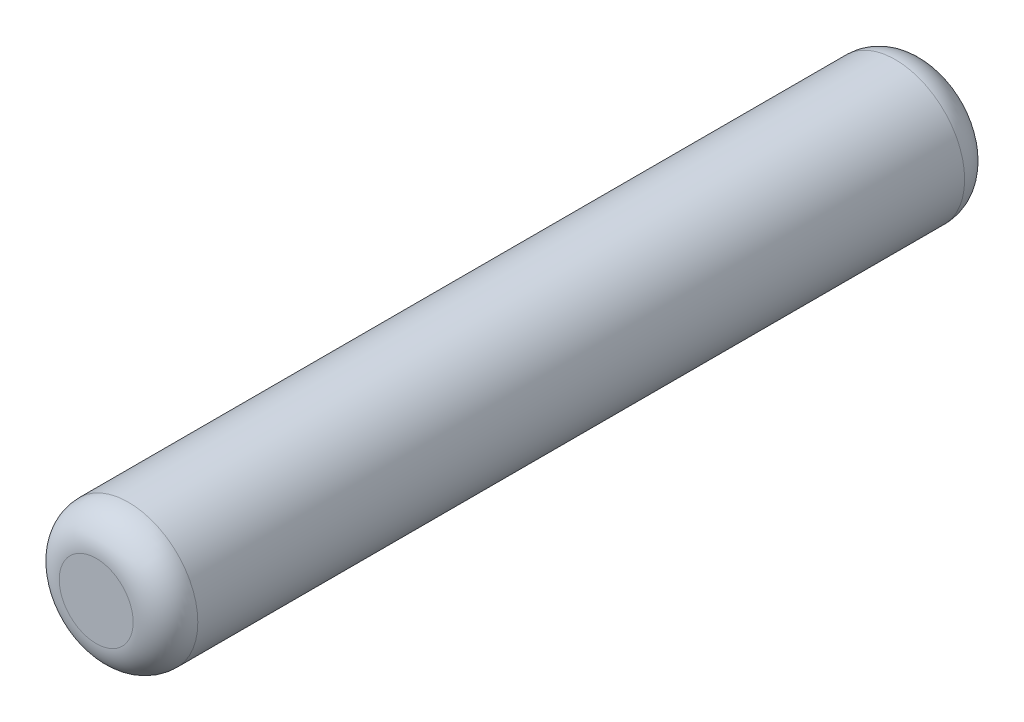
ISO-10303-21;
HEADER;
FILE_DESCRIPTION(('STEP AP214'),'2;1');
FILE_NAME('part.step','',(''),(''),'','','');
FILE_SCHEMA(('AUTOMOTIVE_DESIGN { 1 0 10303 214 1 1 1 1 }'));
ENDSEC;
DATA;
#1=APPLICATION_CONTEXT('core data for automotive mechanical design processes');
#2=APPLICATION_PROTOCOL_DEFINITION('international standard','automotive_design',2000,#1);
#3=PRODUCT_CONTEXT('',#1,'mechanical');
#4=PRODUCT('Part','Part','',(#3));
#5=PRODUCT_RELATED_PRODUCT_CATEGORY('part','',(#4));
#6=PRODUCT_DEFINITION_FORMATION('','',#4);
#7=PRODUCT_DEFINITION_CONTEXT('part definition',#1,'design');
#8=PRODUCT_DEFINITION('design','',#6,#7);
#9=PRODUCT_DEFINITION_SHAPE('','',#8);
#10=(LENGTH_UNIT() NAMED_UNIT(*) SI_UNIT(.MILLI.,.METRE.));
#11=(NAMED_UNIT(*) PLANE_ANGLE_UNIT() SI_UNIT($,.RADIAN.));
#12=(NAMED_UNIT(*) SI_UNIT($,.STERADIAN.) SOLID_ANGLE_UNIT());
#13=UNCERTAINTY_MEASURE_WITH_UNIT(LENGTH_MEASURE(1.E-05),#10,'distance_accuracy_value','');
#14=(GEOMETRIC_REPRESENTATION_CONTEXT(3) GLOBAL_UNCERTAINTY_ASSIGNED_CONTEXT((#13)) GLOBAL_UNIT_ASSIGNED_CONTEXT((#10,
#11,#12)) REPRESENTATION_CONTEXT('',''));
#15=CARTESIAN_POINT('',(0.,0.,0.));
#16=DIRECTION('',(0.,0.,1.));
#17=DIRECTION('',(1.,0.,0.));
#18=AXIS2_PLACEMENT_3D('',#15,#16,#17);
#19=CARTESIAN_POINT('',(0.,0.,4.5));
#20=DIRECTION('',(0.,0.,-1.));
#21=DIRECTION('',(-1.,0.,0.));
#22=AXIS2_PLACEMENT_3D('',#19,#20,#21);
#23=CYLINDRICAL_SURFACE('',#22,0.75);
#24=CARTESIAN_POINT('',(0.,0.,-4.15));
#25=DIRECTION('',(0.,0.,1.));
#26=DIRECTION('',(1.,0.,0.));
#27=AXIS2_PLACEMENT_3D('',#24,#25,#26);
#28=CIRCLE('',#27,0.75);
#29=CARTESIAN_POINT('',(0.75,0.,-4.15));
#30=VERTEX_POINT('',#29);
#31=EDGE_CURVE('E42',#30,#30,#28,.T.);
#32=ORIENTED_EDGE('',*,*,#31,.T.);
#33=EDGE_LOOP('',(#32));
#34=FACE_BOUND('',#33,.T.);
#35=CARTESIAN_POINT('',(0.,0.,4.15));
#36=DIRECTION('',(0.,0.,1.));
#37=DIRECTION('',(1.,0.,0.));
#38=AXIS2_PLACEMENT_3D('',#35,#36,#37);
#39=CIRCLE('',#38,0.75);
#40=CARTESIAN_POINT('',(0.75,0.,4.15));
#41=VERTEX_POINT('',#40);
#42=EDGE_CURVE('E46',#41,#41,#39,.F.);
#43=ORIENTED_EDGE('',*,*,#42,.T.);
#44=EDGE_LOOP('',(#43));
#45=FACE_BOUND('',#44,.T.);
#46=ADVANCED_FACE('F31',(#34,#45),#23,.T.);
#47=CARTESIAN_POINT('',(0.,0.,4.5));
#48=DIRECTION('',(0.,0.,1.));
#49=DIRECTION('',(1.,0.,0.));
#50=AXIS2_PLACEMENT_3D('',#47,#48,#49);
#51=PLANE('',#50);
#52=CARTESIAN_POINT('',(0.,0.,4.5));
#53=DIRECTION('',(0.,0.,1.));
#54=DIRECTION('',(1.,0.,0.));
#55=AXIS2_PLACEMENT_3D('',#52,#53,#54);
#56=CIRCLE('',#55,0.4);
#57=CARTESIAN_POINT('',(0.4,0.,4.5));
#58=VERTEX_POINT('',#57);
#59=EDGE_CURVE('E10',#58,#58,#56,.T.);
#60=ORIENTED_EDGE('',*,*,#59,.T.);
#61=EDGE_LOOP('',(#60));
#62=FACE_BOUND('',#61,.T.);
#63=ADVANCED_FACE('F62',(#62),#51,.T.);
#64=CARTESIAN_POINT('',(0.,0.,-4.5));
#65=DIRECTION('',(0.,0.,1.));
#66=DIRECTION('',(1.,0.,0.));
#67=AXIS2_PLACEMENT_3D('',#64,#65,#66);
#68=PLANE('',#67);
#69=CARTESIAN_POINT('',(0.,0.,-4.5));
#70=DIRECTION('',(0.,0.,1.));
#71=DIRECTION('',(1.,0.,0.));
#72=AXIS2_PLACEMENT_3D('',#69,#70,#71);
#73=CIRCLE('',#72,0.4);
#74=CARTESIAN_POINT('',(0.4,0.,-4.5));
#75=VERTEX_POINT('',#74);
#76=EDGE_CURVE('E38',#75,#75,#73,.F.);
#77=ORIENTED_EDGE('',*,*,#76,.T.);
#78=EDGE_LOOP('',(#77));
#79=FACE_BOUND('',#78,.T.);
#80=ADVANCED_FACE('F59',(#79),#68,.F.);
#81=CARTESIAN_POINT('',(0.,0.,-4.15));
#82=DIRECTION('',(0.,0.,1.));
#83=DIRECTION('',(1.,0.,0.));
#84=AXIS2_PLACEMENT_3D('',#81,#82,#83);
#85=TOROIDAL_SURFACE('',#84,0.4,0.35);
#86=ORIENTED_EDGE('',*,*,#76,.F.);
#87=EDGE_LOOP('',(#86));
#88=FACE_BOUND('',#87,.T.);
#89=ORIENTED_EDGE('',*,*,#31,.F.);
#90=EDGE_LOOP('',(#89));
#91=FACE_BOUND('',#90,.T.);
#92=ADVANCED_FACE('F55',(#88,#91),#85,.T.);
#93=CARTESIAN_POINT('',(0.,0.,4.15));
#94=DIRECTION('',(0.,0.,1.));
#95=DIRECTION('',(1.,0.,0.));
#96=AXIS2_PLACEMENT_3D('',#93,#94,#95);
#97=TOROIDAL_SURFACE('',#96,0.4,0.35);
#98=ORIENTED_EDGE('',*,*,#42,.F.);
#99=EDGE_LOOP('',(#98));
#100=FACE_BOUND('',#99,.T.);
#101=ORIENTED_EDGE('',*,*,#59,.F.);
#102=EDGE_LOOP('',(#101));
#103=FACE_BOUND('',#102,.T.);
#104=ADVANCED_FACE('F33',(#100,#103),#97,.T.);
#105=CLOSED_SHELL('',(#46,#63,#80,#92,#104));
#106=MANIFOLD_SOLID_BREP('B2',#105);
#107=ADVANCED_BREP_SHAPE_REPRESENTATION('',(#18,#106),#14);
#108=SHAPE_DEFINITION_REPRESENTATION(#9,#107);
ENDSEC;
END-ISO-10303-21;
